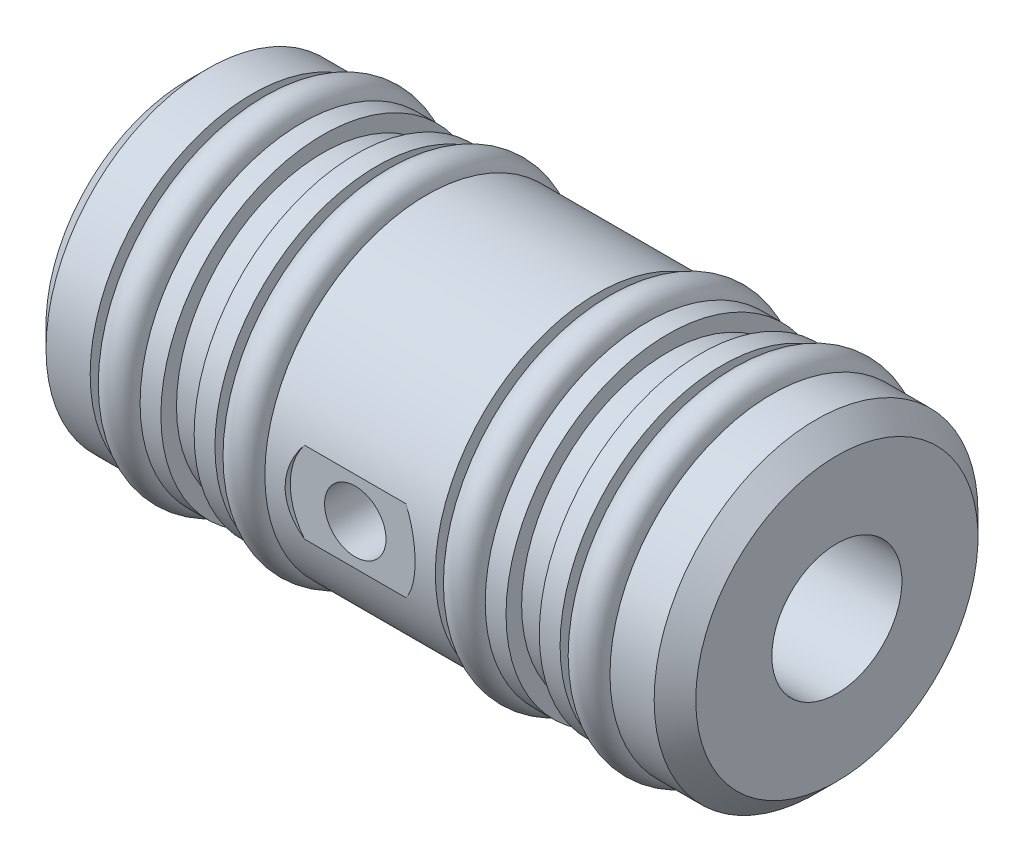
ISO-10303-21;
HEADER;
FILE_DESCRIPTION(('STEP AP214'),'2;1');
FILE_NAME('part.step','',(''),(''),'','','');
FILE_SCHEMA(('AUTOMOTIVE_DESIGN { 1 0 10303 214 1 1 1 1 }'));
ENDSEC;
DATA;
#1=APPLICATION_CONTEXT('core data for automotive mechanical design processes');
#2=APPLICATION_PROTOCOL_DEFINITION('international standard','automotive_design',2000,#1);
#3=PRODUCT_CONTEXT('',#1,'mechanical');
#4=PRODUCT('Part','Part','',(#3));
#5=PRODUCT_RELATED_PRODUCT_CATEGORY('part','',(#4));
#6=PRODUCT_DEFINITION_FORMATION('','',#4);
#7=PRODUCT_DEFINITION_CONTEXT('part definition',#1,'design');
#8=PRODUCT_DEFINITION('design','',#6,#7);
#9=PRODUCT_DEFINITION_SHAPE('','',#8);
#10=(LENGTH_UNIT() NAMED_UNIT(*) SI_UNIT(.MILLI.,.METRE.));
#11=(NAMED_UNIT(*) PLANE_ANGLE_UNIT() SI_UNIT($,.RADIAN.));
#12=(NAMED_UNIT(*) SI_UNIT($,.STERADIAN.) SOLID_ANGLE_UNIT());
#13=UNCERTAINTY_MEASURE_WITH_UNIT(LENGTH_MEASURE(1.E-05),#10,'distance_accuracy_value','');
#14=(GEOMETRIC_REPRESENTATION_CONTEXT(3) GLOBAL_UNCERTAINTY_ASSIGNED_CONTEXT((#13)) GLOBAL_UNIT_ASSIGNED_CONTEXT((#10,
#11,#12)) REPRESENTATION_CONTEXT('',''));
#15=CARTESIAN_POINT('',(0.,0.,0.));
#16=DIRECTION('',(0.,0.,1.));
#17=DIRECTION('',(1.,0.,0.));
#18=AXIS2_PLACEMENT_3D('',#15,#16,#17);
#19=CARTESIAN_POINT('',(0.,0.,0.));
#20=DIRECTION('',(-1.,0.,0.));
#21=DIRECTION('',(0.,0.,1.));
#22=AXIS2_PLACEMENT_3D('',#19,#20,#21);
#23=CYLINDRICAL_SURFACE('',#22,6.6675);
#24=CARTESIAN_POINT('',(3.175,0.,0.));
#25=DIRECTION('',(-1.,0.,0.));
#26=DIRECTION('',(0.,0.,1.));
#27=AXIS2_PLACEMENT_3D('',#24,#25,#26);
#28=CIRCLE('',#27,6.6675);
#29=CARTESIAN_POINT('',(3.175,0.,6.6675));
#30=VERTEX_POINT('',#29);
#31=EDGE_CURVE('E146',#30,#30,#28,.T.);
#32=ORIENTED_EDGE('',*,*,#31,.F.);
#33=EDGE_LOOP('',(#32));
#34=FACE_BOUND('',#33,.T.);
#35=CARTESIAN_POINT('',(4.32820886423164,0.,0.));
#36=DIRECTION('',(1.,0.,0.));
#37=DIRECTION('',(0.,0.,-1.));
#38=AXIS2_PLACEMENT_3D('',#35,#36,#37);
#39=CIRCLE('',#38,6.6675);
#40=CARTESIAN_POINT('',(4.32820886423164,0.,-6.6675));
#41=VERTEX_POINT('',#40);
#42=EDGE_CURVE('E13',#41,#41,#39,.T.);
#43=ORIENTED_EDGE('',*,*,#42,.F.);
#44=EDGE_LOOP('',(#43));
#45=FACE_BOUND('',#44,.T.);
#46=ADVANCED_FACE('F44',(#34,#45),#23,.T.);
#47=CARTESIAN_POINT('',(5.6134,0.,0.));
#48=DIRECTION('',(-1.,0.,0.));
#49=DIRECTION('',(0.,0.,1.));
#50=AXIS2_PLACEMENT_3D('',#47,#48,#49);
#51=CIRCLE('',#50,6.6675);
#52=CARTESIAN_POINT('',(5.6134,0.,6.6675));
#53=VERTEX_POINT('',#52);
#54=EDGE_CURVE('E149',#53,#53,#51,.T.);
#55=ORIENTED_EDGE('',*,*,#54,.T.);
#56=EDGE_LOOP('',(#55));
#57=FACE_BOUND('',#56,.T.);
#58=CARTESIAN_POINT('',(4.46019113576836,0.,0.));
#59=DIRECTION('',(-1.,0.,0.));
#60=DIRECTION('',(0.,0.,1.));
#61=AXIS2_PLACEMENT_3D('',#58,#59,#60);
#62=CIRCLE('',#61,6.6675);
#63=CARTESIAN_POINT('',(4.46019113576836,0.,6.6675));
#64=VERTEX_POINT('',#63);
#65=EDGE_CURVE('E52',#64,#64,#62,.T.);
#66=ORIENTED_EDGE('',*,*,#65,.F.);
#67=EDGE_LOOP('',(#66));
#68=FACE_BOUND('',#67,.T.);
#69=ADVANCED_FACE('F242',(#57,#68),#23,.T.);
#70=CARTESIAN_POINT('',(0.,0.,0.));
#71=DIRECTION('',(-1.,0.,0.));
#72=DIRECTION('',(0.,0.,1.));
#73=AXIS2_PLACEMENT_3D('',#70,#71,#72);
#74=CYLINDRICAL_SURFACE('',#73,6.6675);
#75=CARTESIAN_POINT('',(9.271,0.,0.));
#76=DIRECTION('',(-1.,0.,0.));
#77=DIRECTION('',(0.,0.,1.));
#78=AXIS2_PLACEMENT_3D('',#75,#76,#77);
#79=CIRCLE('',#78,6.6675);
#80=CARTESIAN_POINT('',(9.271,0.,6.6675));
#81=VERTEX_POINT('',#80);
#82=EDGE_CURVE('E170',#81,#81,#79,.T.);
#83=ORIENTED_EDGE('',*,*,#82,.F.);
#84=EDGE_LOOP('',(#83));
#85=FACE_BOUND('',#84,.T.);
#86=CARTESIAN_POINT('',(10.4234088642317,0.,0.));
#87=DIRECTION('',(1.,0.,0.));
#88=DIRECTION('',(0.,0.,-1.));
#89=AXIS2_PLACEMENT_3D('',#86,#87,#88);
#90=CIRCLE('',#89,6.6675);
#91=CARTESIAN_POINT('',(10.4234088642317,0.,-6.6675));
#92=VERTEX_POINT('',#91);
#93=EDGE_CURVE('E358',#92,#92,#90,.T.);
#94=ORIENTED_EDGE('',*,*,#93,.F.);
#95=EDGE_LOOP('',(#94));
#96=FACE_BOUND('',#95,.T.);
#97=ADVANCED_FACE('F248',(#85,#96),#74,.T.);
#98=CARTESIAN_POINT('',(11.7094,0.,0.));
#99=DIRECTION('',(-1.,0.,0.));
#100=DIRECTION('',(0.,0.,1.));
#101=AXIS2_PLACEMENT_3D('',#98,#99,#100);
#102=CIRCLE('',#101,6.6675);
#103=CARTESIAN_POINT('',(11.7094,0.,6.6675));
#104=VERTEX_POINT('',#103);
#105=EDGE_CURVE('E173',#104,#104,#102,.T.);
#106=ORIENTED_EDGE('',*,*,#105,.T.);
#107=EDGE_LOOP('',(#106));
#108=FACE_BOUND('',#107,.T.);
#109=CARTESIAN_POINT('',(10.5553911357683,0.,0.));
#110=DIRECTION('',(-1.,0.,0.));
#111=DIRECTION('',(0.,0.,1.));
#112=AXIS2_PLACEMENT_3D('',#109,#110,#111);
#113=CIRCLE('',#112,6.6675);
#114=CARTESIAN_POINT('',(10.5553911357683,0.,6.6675));
#115=VERTEX_POINT('',#114);
#116=EDGE_CURVE('E354',#115,#115,#113,.T.);
#117=ORIENTED_EDGE('',*,*,#116,.F.);
#118=EDGE_LOOP('',(#117));
#119=FACE_BOUND('',#118,.T.);
#120=ADVANCED_FACE('F338',(#108,#119),#74,.T.);
#121=CARTESIAN_POINT('',(0.,0.,0.));
#122=DIRECTION('',(-1.,0.,0.));
#123=DIRECTION('',(0.,0.,1.));
#124=AXIS2_PLACEMENT_3D('',#121,#122,#123);
#125=CYLINDRICAL_SURFACE('',#124,6.6675);
#126=CARTESIAN_POINT('',(20.0406,0.,0.));
#127=DIRECTION('',(-1.,0.,0.));
#128=DIRECTION('',(0.,0.,1.));
#129=AXIS2_PLACEMENT_3D('',#126,#127,#128);
#130=CIRCLE('',#129,6.6675);
#131=CARTESIAN_POINT('',(20.0406,0.,6.6675));
#132=VERTEX_POINT('',#131);
#133=EDGE_CURVE('E182',#132,#132,#130,.T.);
#134=ORIENTED_EDGE('',*,*,#133,.F.);
#135=EDGE_LOOP('',(#134));
#136=FACE_BOUND('',#135,.T.);
#137=CARTESIAN_POINT('',(21.1946088642316,0.,0.));
#138=DIRECTION('',(1.,0.,0.));
#139=DIRECTION('',(0.,0.,-1.));
#140=AXIS2_PLACEMENT_3D('',#137,#138,#139);
#141=CIRCLE('',#140,6.6675);
#142=CARTESIAN_POINT('',(21.1946088642316,0.,-6.6675));
#143=VERTEX_POINT('',#142);
#144=EDGE_CURVE('E352',#143,#143,#141,.T.);
#145=ORIENTED_EDGE('',*,*,#144,.F.);
#146=EDGE_LOOP('',(#145));
#147=FACE_BOUND('',#146,.T.);
#148=ADVANCED_FACE('F336',(#136,#147),#125,.T.);
#149=CARTESIAN_POINT('',(22.479,0.,0.));
#150=DIRECTION('',(-1.,0.,0.));
#151=DIRECTION('',(0.,0.,1.));
#152=AXIS2_PLACEMENT_3D('',#149,#150,#151);
#153=CIRCLE('',#152,6.6675);
#154=CARTESIAN_POINT('',(22.479,0.,6.6675));
#155=VERTEX_POINT('',#154);
#156=EDGE_CURVE('E185',#155,#155,#153,.T.);
#157=ORIENTED_EDGE('',*,*,#156,.T.);
#158=EDGE_LOOP('',(#157));
#159=FACE_BOUND('',#158,.T.);
#160=CARTESIAN_POINT('',(21.3265911357684,0.,0.));
#161=DIRECTION('',(-1.,0.,0.));
#162=DIRECTION('',(0.,0.,1.));
#163=AXIS2_PLACEMENT_3D('',#160,#161,#162);
#164=CIRCLE('',#163,6.6675);
#165=CARTESIAN_POINT('',(21.3265911357684,0.,6.6675));
#166=VERTEX_POINT('',#165);
#167=EDGE_CURVE('E355',#166,#166,#164,.T.);
#168=ORIENTED_EDGE('',*,*,#167,.F.);
#169=EDGE_LOOP('',(#168));
#170=FACE_BOUND('',#169,.T.);
#171=ADVANCED_FACE('F306',(#159,#170),#125,.T.);
#172=CARTESIAN_POINT('',(0.,0.,0.));
#173=DIRECTION('',(-1.,0.,0.));
#174=DIRECTION('',(0.,0.,1.));
#175=AXIS2_PLACEMENT_3D('',#172,#173,#174);
#176=CYLINDRICAL_SURFACE('',#175,6.6675);
#177=CARTESIAN_POINT('',(26.1366,0.,0.));
#178=DIRECTION('',(-1.,0.,0.));
#179=DIRECTION('',(0.,0.,1.));
#180=AXIS2_PLACEMENT_3D('',#177,#178,#179);
#181=CIRCLE('',#180,6.6675);
#182=CARTESIAN_POINT('',(26.1366,0.,6.6675));
#183=VERTEX_POINT('',#182);
#184=EDGE_CURVE('E206',#183,#183,#181,.T.);
#185=ORIENTED_EDGE('',*,*,#184,.F.);
#186=EDGE_LOOP('',(#185));
#187=FACE_BOUND('',#186,.T.);
#188=CARTESIAN_POINT('',(27.2906088642316,0.,0.));
#189=DIRECTION('',(1.,0.,0.));
#190=DIRECTION('',(0.,0.,-1.));
#191=AXIS2_PLACEMENT_3D('',#188,#189,#190);
#192=CIRCLE('',#191,6.6675);
#193=CARTESIAN_POINT('',(27.2906088642316,0.,-6.6675));
#194=VERTEX_POINT('',#193);
#195=EDGE_CURVE('E361',#194,#194,#192,.T.);
#196=ORIENTED_EDGE('',*,*,#195,.F.);
#197=EDGE_LOOP('',(#196));
#198=FACE_BOUND('',#197,.T.);
#199=ADVANCED_FACE('F303',(#187,#198),#176,.T.);
#200=CARTESIAN_POINT('',(28.575,0.,0.));
#201=DIRECTION('',(-1.,0.,0.));
#202=DIRECTION('',(0.,0.,1.));
#203=AXIS2_PLACEMENT_3D('',#200,#201,#202);
#204=CIRCLE('',#203,6.6675);
#205=CARTESIAN_POINT('',(28.575,0.,6.6675));
#206=VERTEX_POINT('',#205);
#207=EDGE_CURVE('E209',#206,#206,#204,.T.);
#208=ORIENTED_EDGE('',*,*,#207,.T.);
#209=EDGE_LOOP('',(#208));
#210=FACE_BOUND('',#209,.T.);
#211=CARTESIAN_POINT('',(27.4225911357684,0.,0.));
#212=DIRECTION('',(-1.,0.,0.));
#213=DIRECTION('',(0.,0.,1.));
#214=AXIS2_PLACEMENT_3D('',#211,#212,#213);
#215=CIRCLE('',#214,6.6675);
#216=CARTESIAN_POINT('',(27.4225911357684,0.,6.6675));
#217=VERTEX_POINT('',#216);
#218=EDGE_CURVE('E411',#217,#217,#215,.T.);
#219=ORIENTED_EDGE('',*,*,#218,.F.);
#220=EDGE_LOOP('',(#219));
#221=FACE_BOUND('',#220,.T.);
#222=ADVANCED_FACE('F266',(#210,#221),#176,.T.);
#223=CARTESIAN_POINT('',(0.,3.17754,0.));
#224=DIRECTION('',(1.,0.,0.));
#225=DIRECTION('',(0.,0.,-1.));
#226=AXIS2_PLACEMENT_3D('',#223,#224,#225);
#227=PLANE('',#226);
#228=CARTESIAN_POINT('',(0.,0.,0.));
#229=DIRECTION('',(1.,0.,0.));
#230=DIRECTION('',(0.,0.,-1.));
#231=AXIS2_PLACEMENT_3D('',#228,#229,#230);
#232=CIRCLE('',#231,6.89610000000001);
#233=CARTESIAN_POINT('',(0.,0.,-6.89610000000001));
#234=VERTEX_POINT('',#233);
#235=EDGE_CURVE('E140',#234,#234,#232,.F.);
#236=ORIENTED_EDGE('',*,*,#235,.T.);
#237=EDGE_LOOP('',(#236));
#238=FACE_BOUND('',#237,.T.);
#239=CARTESIAN_POINT('',(0.,0.,0.));
#240=DIRECTION('',(-1.,0.,0.));
#241=DIRECTION('',(0.,0.,1.));
#242=AXIS2_PLACEMENT_3D('',#239,#240,#241);
#243=CIRCLE('',#242,3.17754);
#244=CARTESIAN_POINT('',(0.,0.,3.17754));
#245=VERTEX_POINT('',#244);
#246=EDGE_CURVE('E218',#245,#245,#243,.T.);
#247=ORIENTED_EDGE('',*,*,#246,.F.);
#248=EDGE_LOOP('',(#247));
#249=FACE_BOUND('',#248,.T.);
#250=ADVANCED_FACE('F263',(#238,#249),#227,.F.);
#251=CARTESIAN_POINT('',(0.,0.,0.));
#252=DIRECTION('',(-1.,0.,0.));
#253=DIRECTION('',(0.,0.,1.));
#254=AXIS2_PLACEMENT_3D('',#251,#252,#253);
#255=CYLINDRICAL_SURFACE('',#254,7.9121);
#256=CARTESIAN_POINT('',(1.016,0.,0.));
#257=DIRECTION('',(1.,0.,0.));
#258=DIRECTION('',(0.,0.,-1.));
#259=AXIS2_PLACEMENT_3D('',#256,#257,#258);
#260=CIRCLE('',#259,7.9121);
#261=CARTESIAN_POINT('',(1.016,0.,-7.9121));
#262=VERTEX_POINT('',#261);
#263=EDGE_CURVE('E137',#262,#262,#260,.T.);
#264=ORIENTED_EDGE('',*,*,#263,.T.);
#265=EDGE_LOOP('',(#264));
#266=FACE_BOUND('',#265,.T.);
#267=CARTESIAN_POINT('',(3.175,0.,0.));
#268=DIRECTION('',(-1.,0.,0.));
#269=DIRECTION('',(0.,0.,1.));
#270=AXIS2_PLACEMENT_3D('',#267,#268,#269);
#271=CIRCLE('',#270,7.9121);
#272=CARTESIAN_POINT('',(3.175,0.,7.9121));
#273=VERTEX_POINT('',#272);
#274=EDGE_CURVE('E143',#273,#273,#271,.T.);
#275=ORIENTED_EDGE('',*,*,#274,.T.);
#276=EDGE_LOOP('',(#275));
#277=FACE_BOUND('',#276,.T.);
#278=ADVANCED_FACE('F259',(#266,#277),#255,.T.);
#279=CARTESIAN_POINT('',(3.175,7.9121,0.));
#280=DIRECTION('',(-1.,0.,0.));
#281=DIRECTION('',(0.,0.,1.));
#282=AXIS2_PLACEMENT_3D('',#279,#280,#281);
#283=PLANE('',#282);
#284=ORIENTED_EDGE('',*,*,#274,.F.);
#285=EDGE_LOOP('',(#284));
#286=FACE_BOUND('',#285,.T.);
#287=ORIENTED_EDGE('',*,*,#31,.T.);
#288=EDGE_LOOP('',(#287));
#289=FACE_BOUND('',#288,.T.);
#290=ADVANCED_FACE('F256',(#286,#289),#283,.F.);
#291=CARTESIAN_POINT('',(5.6134,6.6675,0.));
#292=DIRECTION('',(1.,0.,0.));
#293=DIRECTION('',(0.,0.,-1.));
#294=AXIS2_PLACEMENT_3D('',#291,#292,#293);
#295=PLANE('',#294);
#296=ORIENTED_EDGE('',*,*,#54,.F.);
#297=EDGE_LOOP('',(#296));
#298=FACE_BOUND('',#297,.T.);
#299=CARTESIAN_POINT('',(5.6134,0.,0.));
#300=DIRECTION('',(-1.,0.,0.));
#301=DIRECTION('',(0.,0.,1.));
#302=AXIS2_PLACEMENT_3D('',#299,#300,#301);
#303=CIRCLE('',#302,7.9121);
#304=CARTESIAN_POINT('',(5.6134,0.,7.9121));
#305=VERTEX_POINT('',#304);
#306=EDGE_CURVE('E152',#305,#305,#303,.T.);
#307=ORIENTED_EDGE('',*,*,#306,.T.);
#308=EDGE_LOOP('',(#307));
#309=FACE_BOUND('',#308,.T.);
#310=ADVANCED_FACE('F254',(#298,#309),#295,.F.);
#311=CARTESIAN_POINT('',(0.,0.,0.));
#312=DIRECTION('',(-1.,0.,0.));
#313=DIRECTION('',(0.,0.,1.));
#314=AXIS2_PLACEMENT_3D('',#311,#312,#313);
#315=CYLINDRICAL_SURFACE('',#314,7.9121);
#316=ORIENTED_EDGE('',*,*,#306,.F.);
#317=EDGE_LOOP('',(#316));
#318=FACE_BOUND('',#317,.T.);
#319=CARTESIAN_POINT('',(6.6294,0.,0.));
#320=DIRECTION('',(-1.,0.,0.));
#321=DIRECTION('',(0.,0.,1.));
#322=AXIS2_PLACEMENT_3D('',#319,#320,#321);
#323=CIRCLE('',#322,7.9121);
#324=CARTESIAN_POINT('',(6.6294,0.,7.9121));
#325=VERTEX_POINT('',#324);
#326=EDGE_CURVE('E155',#325,#325,#323,.T.);
#327=ORIENTED_EDGE('',*,*,#326,.T.);
#328=EDGE_LOOP('',(#327));
#329=FACE_BOUND('',#328,.T.);
#330=ADVANCED_FACE('F446',(#318,#329),#315,.T.);
#331=CARTESIAN_POINT('',(6.6294,7.9121,0.));
#332=DIRECTION('',(-1.,0.,0.));
#333=DIRECTION('',(0.,0.,1.));
#334=AXIS2_PLACEMENT_3D('',#331,#332,#333);
#335=PLANE('',#334);
#336=ORIENTED_EDGE('',*,*,#326,.F.);
#337=EDGE_LOOP('',(#336));
#338=FACE_BOUND('',#337,.T.);
#339=CARTESIAN_POINT('',(6.6294,0.,0.));
#340=DIRECTION('',(-1.,0.,0.));
#341=DIRECTION('',(0.,0.,1.));
#342=AXIS2_PLACEMENT_3D('',#339,#340,#341);
#343=CIRCLE('',#342,7.1501);
#344=CARTESIAN_POINT('',(6.6294,0.,7.1501));
#345=VERTEX_POINT('',#344);
#346=EDGE_CURVE('E158',#345,#345,#343,.T.);
#347=ORIENTED_EDGE('',*,*,#346,.T.);
#348=EDGE_LOOP('',(#347));
#349=FACE_BOUND('',#348,.T.);
#350=ADVANCED_FACE('F453',(#338,#349),#335,.F.);
#351=CARTESIAN_POINT('',(0.,0.,0.));
#352=DIRECTION('',(-1.,0.,0.));
#353=DIRECTION('',(0.,0.,1.));
#354=AXIS2_PLACEMENT_3D('',#351,#352,#353);
#355=CYLINDRICAL_SURFACE('',#354,7.1501);
#356=ORIENTED_EDGE('',*,*,#346,.F.);
#357=EDGE_LOOP('',(#356));
#358=FACE_BOUND('',#357,.T.);
#359=CARTESIAN_POINT('',(8.255,0.,0.));
#360=DIRECTION('',(-1.,0.,0.));
#361=DIRECTION('',(0.,0.,1.));
#362=AXIS2_PLACEMENT_3D('',#359,#360,#361);
#363=CIRCLE('',#362,7.1501);
#364=CARTESIAN_POINT('',(8.255,0.,7.1501));
#365=VERTEX_POINT('',#364);
#366=EDGE_CURVE('E161',#365,#365,#363,.T.);
#367=ORIENTED_EDGE('',*,*,#366,.T.);
#368=EDGE_LOOP('',(#367));
#369=FACE_BOUND('',#368,.T.);
#370=ADVANCED_FACE('F460',(#358,#369),#355,.T.);
#371=CARTESIAN_POINT('',(8.255,7.1501,0.));
#372=DIRECTION('',(1.,0.,0.));
#373=DIRECTION('',(0.,0.,-1.));
#374=AXIS2_PLACEMENT_3D('',#371,#372,#373);
#375=PLANE('',#374);
#376=ORIENTED_EDGE('',*,*,#366,.F.);
#377=EDGE_LOOP('',(#376));
#378=FACE_BOUND('',#377,.T.);
#379=CARTESIAN_POINT('',(8.255,0.,0.));
#380=DIRECTION('',(-1.,0.,0.));
#381=DIRECTION('',(0.,0.,1.));
#382=AXIS2_PLACEMENT_3D('',#379,#380,#381);
#383=CIRCLE('',#382,7.9121);
#384=CARTESIAN_POINT('',(8.255,0.,7.9121));
#385=VERTEX_POINT('',#384);
#386=EDGE_CURVE('E164',#385,#385,#383,.T.);
#387=ORIENTED_EDGE('',*,*,#386,.T.);
#388=EDGE_LOOP('',(#387));
#389=FACE_BOUND('',#388,.T.);
#390=ADVANCED_FACE('F468',(#378,#389),#375,.F.);
#391=CARTESIAN_POINT('',(0.,0.,0.));
#392=DIRECTION('',(-1.,0.,0.));
#393=DIRECTION('',(0.,0.,1.));
#394=AXIS2_PLACEMENT_3D('',#391,#392,#393);
#395=CYLINDRICAL_SURFACE('',#394,7.9121);
#396=ORIENTED_EDGE('',*,*,#386,.F.);
#397=EDGE_LOOP('',(#396));
#398=FACE_BOUND('',#397,.T.);
#399=CARTESIAN_POINT('',(9.271,0.,0.));
#400=DIRECTION('',(-1.,0.,0.));
#401=DIRECTION('',(0.,0.,1.));
#402=AXIS2_PLACEMENT_3D('',#399,#400,#401);
#403=CIRCLE('',#402,7.9121);
#404=CARTESIAN_POINT('',(9.271,0.,7.9121));
#405=VERTEX_POINT('',#404);
#406=EDGE_CURVE('E167',#405,#405,#403,.T.);
#407=ORIENTED_EDGE('',*,*,#406,.T.);
#408=EDGE_LOOP('',(#407));
#409=FACE_BOUND('',#408,.T.);
#410=ADVANCED_FACE('F476',(#398,#409),#395,.T.);
#411=CARTESIAN_POINT('',(9.271,7.9121,0.));
#412=DIRECTION('',(-1.,0.,0.));
#413=DIRECTION('',(0.,0.,1.));
#414=AXIS2_PLACEMENT_3D('',#411,#412,#413);
#415=PLANE('',#414);
#416=ORIENTED_EDGE('',*,*,#406,.F.);
#417=EDGE_LOOP('',(#416));
#418=FACE_BOUND('',#417,.T.);
#419=ORIENTED_EDGE('',*,*,#82,.T.);
#420=EDGE_LOOP('',(#419));
#421=FACE_BOUND('',#420,.T.);
#422=ADVANCED_FACE('F484',(#418,#421),#415,.F.);
#423=CARTESIAN_POINT('',(11.7094,6.6675,0.));
#424=DIRECTION('',(1.,0.,0.));
#425=DIRECTION('',(0.,0.,-1.));
#426=AXIS2_PLACEMENT_3D('',#423,#424,#425);
#427=PLANE('',#426);
#428=ORIENTED_EDGE('',*,*,#105,.F.);
#429=EDGE_LOOP('',(#428));
#430=FACE_BOUND('',#429,.T.);
#431=CARTESIAN_POINT('',(11.7094,0.,0.));
#432=DIRECTION('',(-1.,0.,0.));
#433=DIRECTION('',(0.,0.,1.));
#434=AXIS2_PLACEMENT_3D('',#431,#432,#433);
#435=CIRCLE('',#434,7.9121);
#436=CARTESIAN_POINT('',(11.7094,0.,7.9121));
#437=VERTEX_POINT('',#436);
#438=EDGE_CURVE('E176',#437,#437,#435,.T.);
#439=ORIENTED_EDGE('',*,*,#438,.T.);
#440=EDGE_LOOP('',(#439));
#441=FACE_BOUND('',#440,.T.);
#442=ADVANCED_FACE('F345',(#430,#441),#427,.F.);
#443=CARTESIAN_POINT('',(0.,0.,0.));
#444=DIRECTION('',(-1.,0.,0.));
#445=DIRECTION('',(0.,0.,1.));
#446=AXIS2_PLACEMENT_3D('',#443,#444,#445);
#447=CYLINDRICAL_SURFACE('',#446,7.9121);
#448=DIRECTION('',(-1.,0.,0.));
#449=VECTOR('',#448,1.);
#450=CARTESIAN_POINT('',(0.,-1.98867563971604,7.65809999999999));
#451=LINE('',#450,#449);
#452=CARTESIAN_POINT('',(18.3500341815821,-1.98867563971604,7.65809999999999));
#453=VERTEX_POINT('',#452);
#454=CARTESIAN_POINT('',(13.3999658184179,-1.98867563971604,7.65809999999999));
#455=VERTEX_POINT('',#454);
#456=EDGE_CURVE('E90',#453,#455,#451,.T.);
#457=ORIENTED_EDGE('',*,*,#456,.T.);
#458=CARTESIAN_POINT('',(13.3999658184179,-1.98867563971604,7.65809999999999));
#459=CARTESIAN_POINT('',(13.3459832833482,-1.92149716922292,7.67555056459941));
#460=CARTESIAN_POINT('',(13.2946927423909,-1.85205399953773,7.69263477303759));
#461=CARTESIAN_POINT('',(13.1978097291898,-1.70901602737351,7.72566882669695));
#462=CARTESIAN_POINT('',(13.1522189378534,-1.63542000942563,7.74161833669054));
#463=CARTESIAN_POINT('',(13.0669996988354,-1.48434881619528,7.77199981415083));
#464=CARTESIAN_POINT('',(13.027382899487,-1.40686644515332,7.78642880076185));
#465=CARTESIAN_POINT('',(12.9545452598689,-1.24866499669612,7.81336153108903));
#466=CARTESIAN_POINT('',(12.9213237563443,-1.16794625597453,7.82586547442415));
#467=CARTESIAN_POINT('',(12.8315696771102,-0.921270645456166,7.86002835020451));
#468=CARTESIAN_POINT('',(12.7850752891517,-0.751020281496899,7.87829136971799));
#469=CARTESIAN_POINT('',(12.7209769262732,-0.404668288846624,7.90365051415583));
#470=CARTESIAN_POINT('',(12.7033294422339,-0.228575881673663,7.91076345581933));
#471=CARTESIAN_POINT('',(12.6976594944272,0.116229989465156,7.91303969658664));
#472=CARTESIAN_POINT('',(12.7083402637419,0.284919106809281,7.90872607465757));
#473=CARTESIAN_POINT('',(12.7561841224249,0.61801850293524,7.88969186327279));
#474=CARTESIAN_POINT('',(12.7933686855511,0.782425200005695,7.87496283518052));
#475=CARTESIAN_POINT('',(12.892417705876,1.1011390500175,7.83673637478799));
#476=CARTESIAN_POINT('',(12.9541016320537,1.25551067507812,7.8133031619874));
#477=CARTESIAN_POINT('',(13.1001042139175,1.55169952409804,7.75990706037625));
#478=CARTESIAN_POINT('',(13.1843874819358,1.69353591883316,7.72995439388077));
#479=CARTESIAN_POINT('',(13.2981028380107,1.85509167896367,7.6916039063071));
#480=CARTESIAN_POINT('',(13.3179064050231,1.88229424232692,7.68498964542186));
#481=CARTESIAN_POINT('',(13.3583251030893,1.93600031169406,7.67163538588044));
#482=CARTESIAN_POINT('',(13.3789391416824,1.96250468338201,7.66489556251731));
#483=CARTESIAN_POINT('',(13.3999658184179,1.98867563971604,7.65809999999999));
#484=B_SPLINE_CURVE_WITH_KNOTS('',3,(#458,#459,#460,#461,#462,#463,#464,#465,#466,#467,#468,
#469,#470,#471,#472,#473,#474,#475,#476,#477,#478,#479,#480,#481,#482,#483),.UNSPECIFIED.,.F.,
.F.,(4,2,2,2,2,2,2,2,2,2,2,2,4),(0.,0.263723647141165,0.527524886209317,0.791834023427256,
1.05611573440161,1.5854601786601,2.11400548574343,2.61877799553232,3.12395994489612,
3.6254863909585,4.12623205137405,4.2290996022509,4.3318329534176),.UNSPECIFIED.);
#485=CARTESIAN_POINT('',(12.7,0.,7.9121));
#486=VERTEX_POINT('',#485);
#487=EDGE_CURVE('E109',#455,#486,#484,.T.);
#488=ORIENTED_EDGE('',*,*,#487,.T.);
#489=CARTESIAN_POINT('',(13.3999658184179,1.98867563971604,7.65809999999999));
#490=VERTEX_POINT('',#489);
#491=EDGE_CURVE('E67',#486,#490,#484,.T.);
#492=ORIENTED_EDGE('',*,*,#491,.T.);
#493=DIRECTION('',(-1.,0.,0.));
#494=VECTOR('',#493,1.);
#495=CARTESIAN_POINT('',(0.,1.98867563971604,7.65809999999999));
#496=LINE('',#495,#494);
#497=CARTESIAN_POINT('',(18.3500341815821,1.98867563971604,7.65809999999999));
#498=VERTEX_POINT('',#497);
#499=EDGE_CURVE('E84',#490,#498,#496,.F.);
#500=ORIENTED_EDGE('',*,*,#499,.T.);
#501=CARTESIAN_POINT('',(18.3500341815821,1.98867563971604,7.65809999999999));
#502=CARTESIAN_POINT('',(18.4048865642857,1.92039490732124,7.67583098184861));
#503=CARTESIAN_POINT('',(18.4569414211393,1.84983083659042,7.69317880831805));
#504=CARTESIAN_POINT('',(18.5551613120669,1.7044306670885,7.72669573112614));
#505=CARTESIAN_POINT('',(18.6013250617976,1.62959364188374,7.74286457010092));
#506=CARTESIAN_POINT('',(18.727910155756,1.40378705204603,7.78804670238569));
#507=CARTESIAN_POINT('',(18.7997549215853,1.24736467436272,7.81485086340768));
#508=CARTESIAN_POINT('',(18.8895009078942,1.00081430255808,7.84902036269267));
#509=CARTESIAN_POINT('',(18.9168300728549,0.914404238392325,7.85957766145284));
#510=CARTESIAN_POINT('',(18.9640670701639,0.73925842992002,7.87797950026824));
#511=CARTESIAN_POINT('',(18.9839745709587,0.650522581901541,7.8858239191279));
#512=CARTESIAN_POINT('',(19.01662304255,0.468645608458401,7.89875004313689));
#513=CARTESIAN_POINT('',(19.0291187196871,0.375453736105562,7.90373701856633));
#514=CARTESIAN_POINT('',(19.0458175421047,0.188178509026995,7.91042196613642));
#515=CARTESIAN_POINT('',(19.0500175145821,0.0940948270345538,7.91211867986799));
#516=CARTESIAN_POINT('',(19.05,0.,7.9121));
#517=B_SPLINE_CURVE_WITH_KNOTS('',3,(#501,#502,#503,#504,#505,#506,#507,#508,#509,#510,#511,
#512,#513,#514,#515,#516),.UNSPECIFIED.,.F.,.F.,(4,2,2,2,2,2,2,4),(0.,0.267907635115956,
0.535873578401103,1.05566846597762,1.32909887595843,1.60254149963003,1.88459090044704,
2.16674815395601),.UNSPECIFIED.);
#518=CARTESIAN_POINT('',(19.05,0.,7.9121));
#519=VERTEX_POINT('',#518);
#520=EDGE_CURVE('E78',#498,#519,#517,.T.);
#521=ORIENTED_EDGE('',*,*,#520,.T.);
#522=CARTESIAN_POINT('',(19.05,0.,7.9121));
#523=CARTESIAN_POINT('',(19.050013664492,-0.0867585421193067,7.9121139928132));
#524=CARTESIAN_POINT('',(19.046444551354,-0.173511758316131,7.91067352359511));
#525=CARTESIAN_POINT('',(19.0322425998553,-0.346314136125207,7.90498601765018));
#526=CARTESIAN_POINT('',(19.0216123705603,-0.432363545908239,7.90074001756343));
#527=CARTESIAN_POINT('',(18.9937902734079,-0.600707291084919,7.8897025100128));
#528=CARTESIAN_POINT('',(18.9767931444801,-0.683038895845591,7.88298664746118));
#529=CARTESIAN_POINT('',(18.9363957302808,-0.845883238859792,7.867178518209));
#530=CARTESIAN_POINT('',(18.9129950809307,-0.926395873412081,7.85808611638921));
#531=CARTESIAN_POINT('',(18.8570583330804,-1.0938869917318,7.83662131096481));
#532=CARTESIAN_POINT('',(18.8237966386219,-1.18059153440494,7.82399689290137));
#533=CARTESIAN_POINT('',(18.7499655442812,-1.35047425671724,7.79647082111025));
#534=CARTESIAN_POINT('',(18.7093941769682,-1.43365147949833,7.78156855445365));
#535=CARTESIAN_POINT('',(18.6198866280656,-1.59853165814783,7.74940622956291));
#536=CARTESIAN_POINT('',(18.5707205878319,-1.68009781349334,7.73208507620346));
#537=CARTESIAN_POINT('',(18.4654630888691,-1.83824869116349,7.69602379964387));
#538=CARTESIAN_POINT('',(18.4093746214496,-1.9148355434457,7.67728429068603));
#539=CARTESIAN_POINT('',(18.3500341815821,-1.98867563971604,7.65809999999999));
#540=B_SPLINE_CURVE_WITH_KNOTS('',3,(#522,#523,#524,#525,#526,#527,#528,#529,#530,#531,#532,
#533,#534,#535,#536,#537,#538,#539),.UNSPECIFIED.,.F.,.F.,(4,2,2,2,2,2,2,2,4),(0.,
0.260182362418895,0.520268641506702,0.772975204534644,1.02569613843548,1.3064614335463,
1.58730241108072,1.87731272116155,2.16719814830263),.UNSPECIFIED.);
#541=EDGE_CURVE('E81',#519,#453,#540,.T.);
#542=ORIENTED_EDGE('',*,*,#541,.T.);
#543=EDGE_LOOP('',(#457,#488,#492,#500,#521,#542));
#544=FACE_BOUND('',#543,.T.);
#545=ORIENTED_EDGE('',*,*,#438,.F.);
#546=EDGE_LOOP('',(#545));
#547=FACE_BOUND('',#546,.T.);
#548=CARTESIAN_POINT('',(20.0406,0.,0.));
#549=DIRECTION('',(-1.,0.,0.));
#550=DIRECTION('',(0.,0.,1.));
#551=AXIS2_PLACEMENT_3D('',#548,#549,#550);
#552=CIRCLE('',#551,7.9121);
#553=CARTESIAN_POINT('',(20.0406,0.,7.9121));
#554=VERTEX_POINT('',#553);
#555=EDGE_CURVE('E179',#554,#554,#552,.T.);
#556=ORIENTED_EDGE('',*,*,#555,.T.);
#557=EDGE_LOOP('',(#556));
#558=FACE_BOUND('',#557,.T.);
#559=ADVANCED_FACE('F94',(#544,#547,#558),#447,.T.);
#560=CARTESIAN_POINT('',(20.0406,7.9121,0.));
#561=DIRECTION('',(-1.,0.,0.));
#562=DIRECTION('',(0.,0.,1.));
#563=AXIS2_PLACEMENT_3D('',#560,#561,#562);
#564=PLANE('',#563);
#565=ORIENTED_EDGE('',*,*,#555,.F.);
#566=EDGE_LOOP('',(#565));
#567=FACE_BOUND('',#566,.T.);
#568=ORIENTED_EDGE('',*,*,#133,.T.);
#569=EDGE_LOOP('',(#568));
#570=FACE_BOUND('',#569,.T.);
#571=ADVANCED_FACE('F334',(#567,#570),#564,.F.);
#572=CARTESIAN_POINT('',(22.479,7.9121,0.));
#573=DIRECTION('',(1.,0.,0.));
#574=DIRECTION('',(0.,0.,-1.));
#575=AXIS2_PLACEMENT_3D('',#572,#573,#574);
#576=PLANE('',#575);
#577=ORIENTED_EDGE('',*,*,#156,.F.);
#578=EDGE_LOOP('',(#577));
#579=FACE_BOUND('',#578,.T.);
#580=CARTESIAN_POINT('',(22.479,0.,0.));
#581=DIRECTION('',(-1.,0.,0.));
#582=DIRECTION('',(0.,0.,1.));
#583=AXIS2_PLACEMENT_3D('',#580,#581,#582);
#584=CIRCLE('',#583,7.9121);
#585=CARTESIAN_POINT('',(22.479,0.,7.9121));
#586=VERTEX_POINT('',#585);
#587=EDGE_CURVE('E188',#586,#586,#584,.T.);
#588=ORIENTED_EDGE('',*,*,#587,.T.);
#589=EDGE_LOOP('',(#588));
#590=FACE_BOUND('',#589,.T.);
#591=ADVANCED_FACE('F330',(#579,#590),#576,.F.);
#592=CARTESIAN_POINT('',(0.,0.,0.));
#593=DIRECTION('',(-1.,0.,0.));
#594=DIRECTION('',(0.,0.,1.));
#595=AXIS2_PLACEMENT_3D('',#592,#593,#594);
#596=CYLINDRICAL_SURFACE('',#595,7.9121);
#597=ORIENTED_EDGE('',*,*,#587,.F.);
#598=EDGE_LOOP('',(#597));
#599=FACE_BOUND('',#598,.T.);
#600=CARTESIAN_POINT('',(23.495,0.,0.));
#601=DIRECTION('',(-1.,0.,0.));
#602=DIRECTION('',(0.,0.,1.));
#603=AXIS2_PLACEMENT_3D('',#600,#601,#602);
#604=CIRCLE('',#603,7.9121);
#605=CARTESIAN_POINT('',(23.495,0.,7.9121));
#606=VERTEX_POINT('',#605);
#607=EDGE_CURVE('E191',#606,#606,#604,.T.);
#608=ORIENTED_EDGE('',*,*,#607,.T.);
#609=EDGE_LOOP('',(#608));
#610=FACE_BOUND('',#609,.T.);
#611=ADVANCED_FACE('F326',(#599,#610),#596,.T.);
#612=CARTESIAN_POINT('',(23.495,7.1501,0.));
#613=DIRECTION('',(-1.,0.,0.));
#614=DIRECTION('',(0.,0.,1.));
#615=AXIS2_PLACEMENT_3D('',#612,#613,#614);
#616=PLANE('',#615);
#617=ORIENTED_EDGE('',*,*,#607,.F.);
#618=EDGE_LOOP('',(#617));
#619=FACE_BOUND('',#618,.T.);
#620=CARTESIAN_POINT('',(23.495,0.,0.));
#621=DIRECTION('',(-1.,0.,0.));
#622=DIRECTION('',(0.,0.,1.));
#623=AXIS2_PLACEMENT_3D('',#620,#621,#622);
#624=CIRCLE('',#623,7.1501);
#625=CARTESIAN_POINT('',(23.495,0.,7.1501));
#626=VERTEX_POINT('',#625);
#627=EDGE_CURVE('E194',#626,#626,#624,.T.);
#628=ORIENTED_EDGE('',*,*,#627,.T.);
#629=EDGE_LOOP('',(#628));
#630=FACE_BOUND('',#629,.T.);
#631=ADVANCED_FACE('F322',(#619,#630),#616,.F.);
#632=CARTESIAN_POINT('',(0.,0.,0.));
#633=DIRECTION('',(-1.,0.,0.));
#634=DIRECTION('',(0.,0.,1.));
#635=AXIS2_PLACEMENT_3D('',#632,#633,#634);
#636=CYLINDRICAL_SURFACE('',#635,7.1501);
#637=ORIENTED_EDGE('',*,*,#627,.F.);
#638=EDGE_LOOP('',(#637));
#639=FACE_BOUND('',#638,.T.);
#640=CARTESIAN_POINT('',(25.1206,0.,0.));
#641=DIRECTION('',(-1.,0.,0.));
#642=DIRECTION('',(0.,0.,1.));
#643=AXIS2_PLACEMENT_3D('',#640,#641,#642);
#644=CIRCLE('',#643,7.1501);
#645=CARTESIAN_POINT('',(25.1206,0.,7.1501));
#646=VERTEX_POINT('',#645);
#647=EDGE_CURVE('E197',#646,#646,#644,.T.);
#648=ORIENTED_EDGE('',*,*,#647,.T.);
#649=EDGE_LOOP('',(#648));
#650=FACE_BOUND('',#649,.T.);
#651=ADVANCED_FACE('F318',(#639,#650),#636,.T.);
#652=CARTESIAN_POINT('',(25.1206,7.9121,0.));
#653=DIRECTION('',(1.,0.,0.));
#654=DIRECTION('',(0.,0.,-1.));
#655=AXIS2_PLACEMENT_3D('',#652,#653,#654);
#656=PLANE('',#655);
#657=ORIENTED_EDGE('',*,*,#647,.F.);
#658=EDGE_LOOP('',(#657));
#659=FACE_BOUND('',#658,.T.);
#660=CARTESIAN_POINT('',(25.1206,0.,0.));
#661=DIRECTION('',(-1.,0.,0.));
#662=DIRECTION('',(0.,0.,1.));
#663=AXIS2_PLACEMENT_3D('',#660,#661,#662);
#664=CIRCLE('',#663,7.9121);
#665=CARTESIAN_POINT('',(25.1206,0.,7.9121));
#666=VERTEX_POINT('',#665);
#667=EDGE_CURVE('E200',#666,#666,#664,.T.);
#668=ORIENTED_EDGE('',*,*,#667,.T.);
#669=EDGE_LOOP('',(#668));
#670=FACE_BOUND('',#669,.T.);
#671=ADVANCED_FACE('F314',(#659,#670),#656,.F.);
#672=CARTESIAN_POINT('',(0.,0.,0.));
#673=DIRECTION('',(-1.,0.,0.));
#674=DIRECTION('',(0.,0.,1.));
#675=AXIS2_PLACEMENT_3D('',#672,#673,#674);
#676=CYLINDRICAL_SURFACE('',#675,7.9121);
#677=ORIENTED_EDGE('',*,*,#667,.F.);
#678=EDGE_LOOP('',(#677));
#679=FACE_BOUND('',#678,.T.);
#680=CARTESIAN_POINT('',(26.1366,0.,0.));
#681=DIRECTION('',(-1.,0.,0.));
#682=DIRECTION('',(0.,0.,1.));
#683=AXIS2_PLACEMENT_3D('',#680,#681,#682);
#684=CIRCLE('',#683,7.9121);
#685=CARTESIAN_POINT('',(26.1366,0.,7.9121));
#686=VERTEX_POINT('',#685);
#687=EDGE_CURVE('E203',#686,#686,#684,.T.);
#688=ORIENTED_EDGE('',*,*,#687,.T.);
#689=EDGE_LOOP('',(#688));
#690=FACE_BOUND('',#689,.T.);
#691=ADVANCED_FACE('F310',(#679,#690),#676,.T.);
#692=CARTESIAN_POINT('',(26.1366,6.6675,0.));
#693=DIRECTION('',(-1.,0.,0.));
#694=DIRECTION('',(0.,0.,1.));
#695=AXIS2_PLACEMENT_3D('',#692,#693,#694);
#696=PLANE('',#695);
#697=ORIENTED_EDGE('',*,*,#687,.F.);
#698=EDGE_LOOP('',(#697));
#699=FACE_BOUND('',#698,.T.);
#700=ORIENTED_EDGE('',*,*,#184,.T.);
#701=EDGE_LOOP('',(#700));
#702=FACE_BOUND('',#701,.T.);
#703=ADVANCED_FACE('F301',(#699,#702),#696,.F.);
#704=CARTESIAN_POINT('',(28.575,7.9121,0.));
#705=DIRECTION('',(1.,0.,0.));
#706=DIRECTION('',(0.,0.,-1.));
#707=AXIS2_PLACEMENT_3D('',#704,#705,#706);
#708=PLANE('',#707);
#709=ORIENTED_EDGE('',*,*,#207,.F.);
#710=EDGE_LOOP('',(#709));
#711=FACE_BOUND('',#710,.T.);
#712=CARTESIAN_POINT('',(28.575,0.,0.));
#713=DIRECTION('',(-1.,0.,0.));
#714=DIRECTION('',(0.,0.,1.));
#715=AXIS2_PLACEMENT_3D('',#712,#713,#714);
#716=CIRCLE('',#715,7.9121);
#717=CARTESIAN_POINT('',(28.575,0.,7.9121));
#718=VERTEX_POINT('',#717);
#719=EDGE_CURVE('E212',#718,#718,#716,.T.);
#720=ORIENTED_EDGE('',*,*,#719,.T.);
#721=EDGE_LOOP('',(#720));
#722=FACE_BOUND('',#721,.T.);
#723=ADVANCED_FACE('F294',(#711,#722),#708,.F.);
#724=CARTESIAN_POINT('',(0.,0.,0.));
#725=DIRECTION('',(-1.,0.,0.));
#726=DIRECTION('',(0.,0.,1.));
#727=AXIS2_PLACEMENT_3D('',#724,#725,#726);
#728=CYLINDRICAL_SURFACE('',#727,7.9121);
#729=CARTESIAN_POINT('',(30.734,0.,0.));
#730=DIRECTION('',(-1.,0.,0.));
#731=DIRECTION('',(0.,0.,1.));
#732=AXIS2_PLACEMENT_3D('',#729,#730,#731);
#733=CIRCLE('',#732,7.9121);
#734=CARTESIAN_POINT('',(30.734,0.,7.9121));
#735=VERTEX_POINT('',#734);
#736=EDGE_CURVE('E134',#735,#735,#733,.T.);
#737=ORIENTED_EDGE('',*,*,#736,.T.);
#738=EDGE_LOOP('',(#737));
#739=FACE_BOUND('',#738,.T.);
#740=ORIENTED_EDGE('',*,*,#719,.F.);
#741=EDGE_LOOP('',(#740));
#742=FACE_BOUND('',#741,.T.);
#743=ADVANCED_FACE('F289',(#739,#742),#728,.T.);
#744=CARTESIAN_POINT('',(31.75,3.17754,0.));
#745=DIRECTION('',(-1.,0.,0.));
#746=DIRECTION('',(0.,0.,1.));
#747=AXIS2_PLACEMENT_3D('',#744,#745,#746);
#748=PLANE('',#747);
#749=CARTESIAN_POINT('',(31.75,0.,0.));
#750=DIRECTION('',(-1.,0.,0.));
#751=DIRECTION('',(0.,0.,1.));
#752=AXIS2_PLACEMENT_3D('',#749,#750,#751);
#753=CIRCLE('',#752,6.8961);
#754=CARTESIAN_POINT('',(31.75,0.,6.8961));
#755=VERTEX_POINT('',#754);
#756=EDGE_CURVE('E131',#755,#755,#753,.F.);
#757=ORIENTED_EDGE('',*,*,#756,.T.);
#758=EDGE_LOOP('',(#757));
#759=FACE_BOUND('',#758,.T.);
#760=CARTESIAN_POINT('',(31.75,0.,0.));
#761=DIRECTION('',(-1.,0.,0.));
#762=DIRECTION('',(0.,0.,1.));
#763=AXIS2_PLACEMENT_3D('',#760,#761,#762);
#764=CIRCLE('',#763,3.17754);
#765=CARTESIAN_POINT('',(31.75,0.,3.17754));
#766=VERTEX_POINT('',#765);
#767=EDGE_CURVE('E215',#766,#766,#764,.T.);
#768=ORIENTED_EDGE('',*,*,#767,.T.);
#769=EDGE_LOOP('',(#768));
#770=FACE_BOUND('',#769,.T.);
#771=ADVANCED_FACE('F276',(#759,#770),#748,.F.);
#772=CARTESIAN_POINT('',(0.,0.,0.));
#773=DIRECTION('',(-1.,0.,0.));
#774=DIRECTION('',(0.,0.,1.));
#775=AXIS2_PLACEMENT_3D('',#772,#773,#774);
#776=CYLINDRICAL_SURFACE('',#775,3.17754);
#777=CARTESIAN_POINT('',(17.375,0.,3.17754));
#778=CARTESIAN_POINT('',(17.3749955345504,0.079376480023646,3.17753622848597));
#779=CARTESIAN_POINT('',(17.3686622553031,0.158862924423978,3.17453307898494));
#780=CARTESIAN_POINT('',(17.3435939368515,0.315519141704328,3.16281680697475));
#781=CARTESIAN_POINT('',(17.3248320262396,0.392683515390961,3.15409131284061));
#782=CARTESIAN_POINT('',(17.2757856930617,0.542184770876457,3.13185039605865));
#783=CARTESIAN_POINT('',(17.2455442920016,0.614538505952078,3.11835287028268));
#784=CARTESIAN_POINT('',(17.1746039923733,0.753053588797829,3.08783224352501));
#785=CARTESIAN_POINT('',(17.1339066946744,0.819215882406341,3.07080968232767));
#786=CARTESIAN_POINT('',(17.0406187784931,0.947615947870491,3.03372635651041));
#787=CARTESIAN_POINT('',(16.9874922765297,1.00943033388798,3.01354922464018));
#788=CARTESIAN_POINT('',(16.8719986105212,1.12365386631869,2.97285149791931));
#789=CARTESIAN_POINT('',(16.8096252663904,1.17605667034102,2.95233068156809));
#790=CARTESIAN_POINT('',(16.6723672280534,1.2734803092212,2.91169715398965));
#791=CARTESIAN_POINT('',(16.5969237491791,1.31776951477042,2.89170429878047));
#792=CARTESIAN_POINT('',(16.4385987130837,1.39284517839586,2.85630490220692));
#793=CARTESIAN_POINT('',(16.3557220430897,1.42364043129927,2.84089537571954));
#794=CARTESIAN_POINT('',(16.1897088502828,1.46899076897307,2.81770230827489));
#795=CARTESIAN_POINT('',(16.1068521862909,1.48436593065525,2.8095367150098));
#796=CARTESIAN_POINT('',(15.9393650420428,1.50097414619476,2.8007027108473));
#797=CARTESIAN_POINT('',(15.854736053843,1.502218651752,2.80002822904823));
#798=CARTESIAN_POINT('',(15.6955168764434,1.4911364400335,2.80593918155118));
#799=CARTESIAN_POINT('',(15.6207956945411,1.48020359907355,2.8117790566162));
#800=CARTESIAN_POINT('',(15.474408704333,1.44746487976209,2.82877048201401));
#801=CARTESIAN_POINT('',(15.402743713575,1.4256561116014,2.83992344403555));
#802=CARTESIAN_POINT('',(15.2624975584519,1.37136045251776,2.86654133841664));
#803=CARTESIAN_POINT('',(15.1940262468213,1.33863796739785,2.88210014853236));
#804=CARTESIAN_POINT('',(15.0632361175388,1.26361766107505,2.9157707924705));
#805=CARTESIAN_POINT('',(15.0009200244022,1.22131562666399,2.9338837483123));
#806=CARTESIAN_POINT('',(14.8769005171796,1.12282888851195,2.97306626318227));
#807=CARTESIAN_POINT('',(14.8160387219676,1.06562261390475,2.99424040479752));
#808=CARTESIAN_POINT('',(14.7044453112729,0.941678697675272,3.0355011528828));
#809=CARTESIAN_POINT('',(14.6537175733459,0.874937424401337,3.05558734093892));
#810=CARTESIAN_POINT('',(14.562087564631,0.730635902558739,3.09332987162029));
#811=CARTESIAN_POINT('',(14.5216213366231,0.652765402646906,3.11086793087158));
#812=CARTESIAN_POINT('',(14.4546730890691,0.4902820182008,3.14057065791489));
#813=CARTESIAN_POINT('',(14.4281811278286,0.405673976403321,3.15273914476463));
#814=CARTESIAN_POINT('',(14.3919107592063,0.239061702242264,3.1695548542636));
#815=CARTESIAN_POINT('',(14.3810091157681,0.157353170077875,3.17470610057293));
#816=CARTESIAN_POINT('',(14.3727667359939,-0.00688437224244565,3.17859233057984));
#817=CARTESIAN_POINT('',(14.3754205637229,-0.0894130402632988,3.17732988625888));
#818=CARTESIAN_POINT('',(14.3935030360504,-0.247058360330224,3.16883882100302));
#819=CARTESIAN_POINT('',(14.4080594078756,-0.322299901769429,3.16201767893311));
#820=CARTESIAN_POINT('',(14.448220796273,-0.469145449262083,3.14358745173347));
#821=CARTESIAN_POINT('',(14.473827093832,-0.540749032501244,3.13197781149353));
#822=CARTESIAN_POINT('',(14.536123318651,-0.680780212202779,3.10460081231951));
#823=CARTESIAN_POINT('',(14.5731266713677,-0.74904496895652,3.08871773448431));
#824=CARTESIAN_POINT('',(14.6568230690219,-0.87863641703333,3.054383690571));
#825=CARTESIAN_POINT('',(14.7035203661642,-0.939960045359701,3.03593159878023));
#826=CARTESIAN_POINT('',(14.8101280393207,-1.0597345888865,2.99633931090183));
#827=CARTESIAN_POINT('',(14.8708471186876,-1.11743663680254,2.97510635942674));
#828=CARTESIAN_POINT('',(15.0012706850958,-1.2221270962181,2.93365690910772));
#829=CARTESIAN_POINT('',(15.0709797258889,-1.26911004446405,2.91344093266351));
#830=CARTESIAN_POINT('',(15.2205557071388,-1.35250955157978,2.87570022715598));
#831=CARTESIAN_POINT('',(15.3006917705965,-1.38850137530452,2.85829367334618));
#832=CARTESIAN_POINT('',(15.4669790224032,-1.4461113623409,2.82958927138847));
#833=CARTESIAN_POINT('',(15.5531232462544,-1.46774587202306,2.81828447889176));
#834=CARTESIAN_POINT('',(15.7205323495141,-1.49420640693868,2.80433790098094));
#835=CARTESIAN_POINT('',(15.8015246974518,-1.50038664195916,2.80099945027946));
#836=CARTESIAN_POINT('',(15.9634124963891,-1.49957617174842,2.80143438879144));
#837=CARTESIAN_POINT('',(16.0443079692105,-1.49258942875287,2.80520563853849));
#838=CARTESIAN_POINT('',(16.19724819388,-1.46687144866282,2.81872861381218));
#839=CARTESIAN_POINT('',(16.2694974690135,-1.44907639783587,2.82800237760756));
#840=CARTESIAN_POINT('',(16.4099441676674,-1.403315273387,2.85098552155319));
#841=CARTESIAN_POINT('',(16.4781403658469,-1.37534614191509,2.86469623510492));
#842=CARTESIAN_POINT('',(16.6135422151689,-1.3079190103091,2.89613139536715));
#843=CARTESIAN_POINT('',(16.680379439501,-1.26781993490569,2.91406233507547));
#844=CARTESIAN_POINT('',(16.806792240978,-1.17804076382758,2.95149878450247));
#845=CARTESIAN_POINT('',(16.8663643290603,-1.12835609403889,2.97100504334778));
#846=CARTESIAN_POINT('',(16.9829554855381,-1.01475381606026,3.01181669766893));
#847=CARTESIAN_POINT('',(17.039070209231,-0.949894815618521,3.03309905348557));
#848=CARTESIAN_POINT('',(17.1397672828927,-0.810999398569516,3.07315129962631));
#849=CARTESIAN_POINT('',(17.1843440625949,-0.736958574597226,3.09191997429811));
#850=CARTESIAN_POINT('',(17.2602790626018,-0.581755308456925,3.12483445148365));
#851=CARTESIAN_POINT('',(17.2916846279369,-0.500619663126657,3.13899676998075));
#852=CARTESIAN_POINT('',(17.3400294908019,-0.333481022876481,3.16110784272652));
#853=CARTESIAN_POINT('',(17.3570115541136,-0.247493228893329,3.16907495981383));
#854=CARTESIAN_POINT('',(17.3692459084948,-0.133991408402207,3.17482743753641));
#855=CARTESIAN_POINT('',(17.3714012477443,-0.107252797712571,3.17584252439724));
#856=CARTESIAN_POINT('',(17.374279064293,-0.0536803190214068,3.17719945077749));
#857=CARTESIAN_POINT('',(17.3750015102895,-0.0268464489516859,3.17754127558893));
#858=CARTESIAN_POINT('',(17.375,0.,3.17754));
#859=B_SPLINE_CURVE_WITH_KNOTS('',3,(#777,#778,#779,#780,#781,#782,#783,#784,#785,#786,#787,
#788,#789,#790,#791,#792,#793,#794,#795,#796,#797,#798,#799,#800,#801,#802,#803,#804,#805,#806,
#807,#808,#809,#810,#811,#812,#813,#814,#815,#816,#817,#818,#819,#820,#821,#822,#823,#824,#825,
#826,#827,#828,#829,#830,#831,#832,#833,#834,#835,#836,#837,#838,#839,#840,#841,#842,#843,#844,
#845,#846,#847,#848,#849,#850,#851,#852,#853,#854,#855,#856,#857,#858),.UNSPECIFIED.,.T.,.F.,(4,
2,2,2,2,2,2,2,2,2,2,2,2,2,2,2,2,2,2,2,2,2,2,2,2,2,2,2,2,2,2,2,2,2,2,2,2,2,2,2,4),(0.,
0.238019852623096,0.476556004650755,0.714206885938223,0.951821402910498,1.20266099280379,
1.45366899239137,1.7215259017826,1.98920797196631,2.24174893596012,2.49408522227137,
2.7202556850069,2.94648627484551,3.17795605586685,3.40952783865744,3.66689713664512,
3.92436472304516,4.19141647045611,4.45827797247635,4.70473117178962,4.95108554765641,
5.18085075081668,5.41064259716843,5.6474236718981,5.88430882987331,6.14240447598909,
6.40063137450558,6.66784693108433,6.93475772781895,7.17730094460093,7.41977118640442,
7.64375217825234,7.86780054394505,8.10676982019651,8.34585341261923,8.60971355992805,
8.87370085652715,9.13673092241467,9.39897835239576,9.47947887636609,9.55998115891919),.UNSPECIFIED.);
#860=CARTESIAN_POINT('',(17.375,0.,3.17754));
#861=VERTEX_POINT('',#860);
#862=EDGE_CURVE('E92',#861,#861,#859,.T.);
#863=ORIENTED_EDGE('',*,*,#862,.T.);
#864=EDGE_LOOP('',(#863));
#865=FACE_BOUND('',#864,.T.);
#866=ORIENTED_EDGE('',*,*,#767,.F.);
#867=EDGE_LOOP('',(#866));
#868=FACE_BOUND('',#867,.T.);
#869=ORIENTED_EDGE('',*,*,#246,.T.);
#870=EDGE_LOOP('',(#869));
#871=FACE_BOUND('',#870,.T.);
#872=ADVANCED_FACE('F122',(#865,#868,#871),#776,.F.);
#873=CARTESIAN_POINT('',(0.,0.,0.));
#874=DIRECTION('',(1.,0.,0.));
#875=DIRECTION('',(0.,0.,-1.));
#876=AXIS2_PLACEMENT_3D('',#873,#874,#875);
#877=CONICAL_SURFACE('',#876,6.89610000000001,0.785398163397447);
#878=ORIENTED_EDGE('',*,*,#263,.F.);
#879=EDGE_LOOP('',(#878));
#880=FACE_BOUND('',#879,.T.);
#881=ORIENTED_EDGE('',*,*,#235,.F.);
#882=EDGE_LOOP('',(#881));
#883=FACE_BOUND('',#882,.T.);
#884=ADVANCED_FACE('F268',(#880,#883),#877,.T.);
#885=CARTESIAN_POINT('',(30.734,0.,0.));
#886=DIRECTION('',(-1.,0.,0.));
#887=DIRECTION('',(0.,0.,1.));
#888=AXIS2_PLACEMENT_3D('',#885,#886,#887);
#889=CONICAL_SURFACE('',#888,7.9121,0.785398163397448);
#890=ORIENTED_EDGE('',*,*,#756,.F.);
#891=EDGE_LOOP('',(#890));
#892=FACE_BOUND('',#891,.T.);
#893=ORIENTED_EDGE('',*,*,#736,.F.);
#894=EDGE_LOOP('',(#893));
#895=FACE_BOUND('',#894,.T.);
#896=ADVANCED_FACE('F46',(#892,#895),#889,.T.);
#897=CARTESIAN_POINT('',(15.875,0.,7.65809999999999));
#898=DIRECTION('',(0.,0.,-1.));
#899=DIRECTION('',(-1.,0.,0.));
#900=AXIS2_PLACEMENT_3D('',#897,#898,#899);
#901=PLANE('',#900);
#902=CARTESIAN_POINT('',(15.875,0.,7.65809999999999));
#903=DIRECTION('',(0.,0.,1.));
#904=DIRECTION('',(1.,0.,0.));
#905=AXIS2_PLACEMENT_3D('',#902,#903,#904);
#906=CIRCLE('',#905,1.5);
#907=CARTESIAN_POINT('',(17.375,0.,7.65809999999999));
#908=VERTEX_POINT('',#907);
#909=EDGE_CURVE('E221',#908,#908,#906,.T.);
#910=ORIENTED_EDGE('',*,*,#909,.F.);
#911=EDGE_LOOP('',(#910));
#912=FACE_BOUND('',#911,.T.);
#913=CARTESIAN_POINT('',(15.875,0.,7.65809999999999));
#914=DIRECTION('',(0.,0.,1.));
#915=DIRECTION('',(1.,0.,0.));
#916=AXIS2_PLACEMENT_3D('',#913,#914,#915);
#917=CIRCLE('',#916,3.175);
#918=EDGE_CURVE('E59',#453,#498,#917,.T.);
#919=ORIENTED_EDGE('',*,*,#918,.T.);
#920=ORIENTED_EDGE('',*,*,#499,.F.);
#921=EDGE_CURVE('E91',#490,#455,#917,.T.);
#922=ORIENTED_EDGE('',*,*,#921,.T.);
#923=ORIENTED_EDGE('',*,*,#456,.F.);
#924=EDGE_LOOP('',(#919,#920,#922,#923));
#925=FACE_BOUND('',#924,.T.);
#926=ADVANCED_FACE('F87',(#912,#925),#901,.F.);
#927=CARTESIAN_POINT('',(15.875,0.,7.9121));
#928=DIRECTION('',(0.,0.,1.));
#929=DIRECTION('',(1.,0.,0.));
#930=AXIS2_PLACEMENT_3D('',#927,#928,#929);
#931=CYLINDRICAL_SURFACE('',#930,3.175);
#932=ORIENTED_EDGE('',*,*,#921,.F.);
#933=ORIENTED_EDGE('',*,*,#491,.F.);
#934=ORIENTED_EDGE('',*,*,#487,.F.);
#935=EDGE_LOOP('',(#932,#933,#934));
#936=FACE_BOUND('',#935,.T.);
#937=ADVANCED_FACE('F118',(#936),#931,.F.);
#938=ORIENTED_EDGE('',*,*,#918,.F.);
#939=ORIENTED_EDGE('',*,*,#541,.F.);
#940=ORIENTED_EDGE('',*,*,#520,.F.);
#941=EDGE_LOOP('',(#938,#939,#940));
#942=FACE_BOUND('',#941,.T.);
#943=ADVANCED_FACE('F79',(#942),#931,.F.);
#944=CARTESIAN_POINT('',(15.875,0.,7.65809999999999));
#945=DIRECTION('',(0.,0.,1.));
#946=DIRECTION('',(1.,0.,0.));
#947=AXIS2_PLACEMENT_3D('',#944,#945,#946);
#948=CYLINDRICAL_SURFACE('',#947,1.5);
#949=ORIENTED_EDGE('',*,*,#909,.T.);
#950=EDGE_LOOP('',(#949));
#951=FACE_BOUND('',#950,.T.);
#952=ORIENTED_EDGE('',*,*,#862,.F.);
#953=EDGE_LOOP('',(#952));
#954=FACE_BOUND('',#953,.T.);
#955=ADVANCED_FACE('F230',(#951,#954),#948,.F.);
#956=CARTESIAN_POINT('',(27.3566,0.,0.));
#957=DIRECTION('',(-1.,0.,0.));
#958=DIRECTION('',(0.,0.,1.));
#959=AXIS2_PLACEMENT_3D('',#956,#957,#958);
#960=TOROIDAL_SURFACE('',#959,7.52348,0.858520000000003);
#961=ORIENTED_EDGE('',*,*,#218,.T.);
#962=EDGE_LOOP('',(#961));
#963=FACE_BOUND('',#962,.T.);
#964=ORIENTED_EDGE('',*,*,#195,.T.);
#965=EDGE_LOOP('',(#964));
#966=FACE_BOUND('',#965,.T.);
#967=ADVANCED_FACE('F232',(#963,#966),#960,.T.);
#968=CARTESIAN_POINT('',(21.2606,0.,0.));
#969=DIRECTION('',(-1.,0.,0.));
#970=DIRECTION('',(0.,0.,1.));
#971=AXIS2_PLACEMENT_3D('',#968,#969,#970);
#972=TOROIDAL_SURFACE('',#971,7.52348,0.858520000000003);
#973=ORIENTED_EDGE('',*,*,#167,.T.);
#974=EDGE_LOOP('',(#973));
#975=FACE_BOUND('',#974,.T.);
#976=ORIENTED_EDGE('',*,*,#144,.T.);
#977=EDGE_LOOP('',(#976));
#978=FACE_BOUND('',#977,.T.);
#979=ADVANCED_FACE('F237',(#975,#978),#972,.T.);
#980=CARTESIAN_POINT('',(10.4894,0.,0.));
#981=DIRECTION('',(-1.,0.,0.));
#982=DIRECTION('',(0.,0.,1.));
#983=AXIS2_PLACEMENT_3D('',#980,#981,#982);
#984=TOROIDAL_SURFACE('',#983,7.52348,0.858519999999999);
#985=ORIENTED_EDGE('',*,*,#116,.T.);
#986=EDGE_LOOP('',(#985));
#987=FACE_BOUND('',#986,.T.);
#988=ORIENTED_EDGE('',*,*,#93,.T.);
#989=EDGE_LOOP('',(#988));
#990=FACE_BOUND('',#989,.T.);
#991=ADVANCED_FACE('F373',(#987,#990),#984,.T.);
#992=CARTESIAN_POINT('',(4.3942,0.,0.));
#993=DIRECTION('',(-1.,0.,0.));
#994=DIRECTION('',(0.,0.,1.));
#995=AXIS2_PLACEMENT_3D('',#992,#993,#994);
#996=TOROIDAL_SURFACE('',#995,7.52348,0.85852);
#997=ORIENTED_EDGE('',*,*,#65,.T.);
#998=EDGE_LOOP('',(#997));
#999=FACE_BOUND('',#998,.T.);
#1000=ORIENTED_EDGE('',*,*,#42,.T.);
#1001=EDGE_LOOP('',(#1000));
#1002=FACE_BOUND('',#1001,.T.);
#1003=ADVANCED_FACE('F369',(#999,#1002),#996,.T.);
#1004=CLOSED_SHELL('',(#46,#69,#97,#120,#148,#171,#199,#222,#250,#278,#290,#310,#330,#350,#370,
#390,#410,#422,#442,#559,#571,#591,#611,#631,#651,#671,#691,#703,#723,#743,#771,#872,#884,#896,
#926,#937,#943,#955,#967,#979,#991,#1003));
#1005=MANIFOLD_SOLID_BREP('B2',#1004);
#1006=ADVANCED_BREP_SHAPE_REPRESENTATION('',(#18,#1005),#14);
#1007=SHAPE_DEFINITION_REPRESENTATION(#9,#1006);
ENDSEC;
END-ISO-10303-21;
